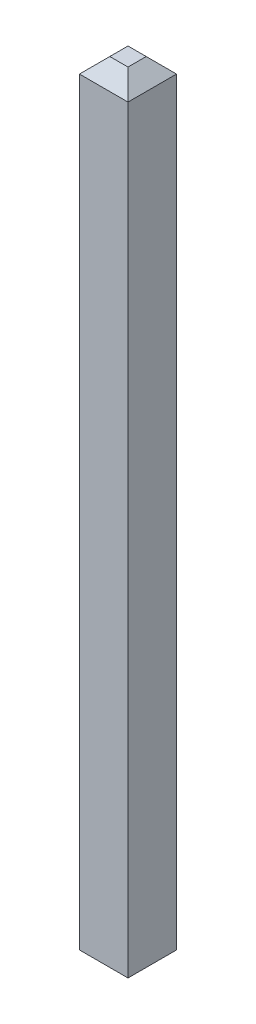
ISO-10303-21;
HEADER;
FILE_DESCRIPTION(('STEP AP214'),'2;1');
FILE_NAME('part.step','',(''),(''),'','','');
FILE_SCHEMA(('AUTOMOTIVE_DESIGN { 1 0 10303 214 1 1 1 1 }'));
ENDSEC;
DATA;
#1=APPLICATION_CONTEXT('core data for automotive mechanical design processes');
#2=APPLICATION_PROTOCOL_DEFINITION('international standard','automotive_design',2000,#1);
#3=PRODUCT_CONTEXT('',#1,'mechanical');
#4=PRODUCT('Part','Part','',(#3));
#5=PRODUCT_RELATED_PRODUCT_CATEGORY('part','',(#4));
#6=PRODUCT_DEFINITION_FORMATION('','',#4);
#7=PRODUCT_DEFINITION_CONTEXT('part definition',#1,'design');
#8=PRODUCT_DEFINITION('design','',#6,#7);
#9=PRODUCT_DEFINITION_SHAPE('','',#8);
#10=(LENGTH_UNIT() NAMED_UNIT(*) SI_UNIT(.MILLI.,.METRE.));
#11=(NAMED_UNIT(*) PLANE_ANGLE_UNIT() SI_UNIT($,.RADIAN.));
#12=(NAMED_UNIT(*) SI_UNIT($,.STERADIAN.) SOLID_ANGLE_UNIT());
#13=UNCERTAINTY_MEASURE_WITH_UNIT(LENGTH_MEASURE(1.E-05),#10,'distance_accuracy_value','');
#14=(GEOMETRIC_REPRESENTATION_CONTEXT(3) GLOBAL_UNCERTAINTY_ASSIGNED_CONTEXT((#13)) GLOBAL_UNIT_ASSIGNED_CONTEXT((#10,
#11,#12)) REPRESENTATION_CONTEXT('',''));
#15=CARTESIAN_POINT('',(0.,0.,0.));
#16=DIRECTION('',(0.,0.,1.));
#17=DIRECTION('',(1.,0.,0.));
#18=AXIS2_PLACEMENT_3D('',#15,#16,#17);
#19=CARTESIAN_POINT('',(0.,10.4,0.12));
#20=DIRECTION('',(0.,-0.707106781186544,-0.707106781186551));
#21=DIRECTION('',(0.,-0.707106781186551,0.707106781186544));
#22=AXIS2_PLACEMENT_3D('',#19,#20,#21);
#23=PLANE('',#22);
#24=DIRECTION('',(-0.577350269189624,-0.577350269189629,0.577350269189624));
#25=VECTOR('',#24,1.);
#26=CARTESIAN_POINT('',(-0.08,10.44,0.08));
#27=LINE('',#26,#25);
#28=CARTESIAN_POINT('',(-0.12,10.4,0.12));
#29=VERTEX_POINT('',#28);
#30=CARTESIAN_POINT('',(-0.32,10.2,0.32));
#31=VERTEX_POINT('',#30);
#32=EDGE_CURVE('E27',#29,#31,#27,.T.);
#33=ORIENTED_EDGE('',*,*,#32,.T.);
#34=DIRECTION('',(-1.,0.,0.));
#35=VECTOR('',#34,1.);
#36=CARTESIAN_POINT('',(-0.32,10.2,0.32));
#37=LINE('',#36,#35);
#38=CARTESIAN_POINT('',(0.32,10.2,0.32));
#39=VERTEX_POINT('',#38);
#40=EDGE_CURVE('E146',#39,#31,#37,.T.);
#41=ORIENTED_EDGE('',*,*,#40,.F.);
#42=DIRECTION('',(-0.577350269189624,0.577350269189629,-0.577350269189624));
#43=VECTOR('',#42,1.);
#44=CARTESIAN_POINT('',(0.08,10.44,0.08));
#45=LINE('',#44,#43);
#46=CARTESIAN_POINT('',(0.12,10.4,0.12));
#47=VERTEX_POINT('',#46);
#48=EDGE_CURVE('E11',#39,#47,#45,.T.);
#49=ORIENTED_EDGE('',*,*,#48,.T.);
#50=DIRECTION('',(1.,0.,0.));
#51=VECTOR('',#50,1.);
#52=CARTESIAN_POINT('',(0.,10.4,0.12));
#53=LINE('',#52,#51);
#54=EDGE_CURVE('E177',#29,#47,#53,.T.);
#55=ORIENTED_EDGE('',*,*,#54,.F.);
#56=EDGE_LOOP('',(#33,#41,#49,#55));
#57=FACE_BOUND('',#56,.T.);
#58=ADVANCED_FACE('F17',(#57),#23,.F.);
#59=CARTESIAN_POINT('',(0.12,10.4,0.));
#60=DIRECTION('',(-0.707106781186551,-0.707106781186544,0.));
#61=DIRECTION('',(-0.707106781186544,0.707106781186551,0.));
#62=AXIS2_PLACEMENT_3D('',#59,#60,#61);
#63=PLANE('',#62);
#64=DIRECTION('',(-0.577350269189624,0.577350269189629,0.577350269189624));
#65=VECTOR('',#64,1.);
#66=CARTESIAN_POINT('',(0.08,10.44,-0.08));
#67=LINE('',#66,#65);
#68=CARTESIAN_POINT('',(0.32,10.2,-0.32));
#69=VERTEX_POINT('',#68);
#70=CARTESIAN_POINT('',(0.12,10.4,-0.12));
#71=VERTEX_POINT('',#70);
#72=EDGE_CURVE('E165',#69,#71,#67,.T.);
#73=ORIENTED_EDGE('',*,*,#72,.T.);
#74=DIRECTION('',(0.,0.,-1.));
#75=VECTOR('',#74,1.);
#76=CARTESIAN_POINT('',(0.12,10.4,0.));
#77=LINE('',#76,#75);
#78=EDGE_CURVE('E137',#47,#71,#77,.T.);
#79=ORIENTED_EDGE('',*,*,#78,.F.);
#80=ORIENTED_EDGE('',*,*,#48,.F.);
#81=DIRECTION('',(0.,0.,1.));
#82=VECTOR('',#81,1.);
#83=CARTESIAN_POINT('',(0.32,10.2,0.32));
#84=LINE('',#83,#82);
#85=EDGE_CURVE('E140',#69,#39,#84,.T.);
#86=ORIENTED_EDGE('',*,*,#85,.F.);
#87=EDGE_LOOP('',(#73,#79,#80,#86));
#88=FACE_BOUND('',#87,.T.);
#89=ADVANCED_FACE('F401',(#88),#63,.F.);
#90=CARTESIAN_POINT('',(-0.12,10.4,0.));
#91=DIRECTION('',(0.707106781186551,-0.707106781186544,0.));
#92=DIRECTION('',(0.,0.,-1.));
#93=AXIS2_PLACEMENT_3D('',#90,#91,#92);
#94=PLANE('',#93);
#95=DIRECTION('',(-0.577350269189624,-0.577350269189629,-0.577350269189624));
#96=VECTOR('',#95,1.);
#97=CARTESIAN_POINT('',(-0.08,10.44,-0.08));
#98=LINE('',#97,#96);
#99=CARTESIAN_POINT('',(-0.12,10.4,-0.12));
#100=VERTEX_POINT('',#99);
#101=CARTESIAN_POINT('',(-0.32,10.2,-0.32));
#102=VERTEX_POINT('',#101);
#103=EDGE_CURVE('E162',#100,#102,#98,.T.);
#104=ORIENTED_EDGE('',*,*,#103,.T.);
#105=DIRECTION('',(0.,0.,-1.));
#106=VECTOR('',#105,1.);
#107=CARTESIAN_POINT('',(-0.32,10.2,0.32));
#108=LINE('',#107,#106);
#109=EDGE_CURVE('E154',#31,#102,#108,.T.);
#110=ORIENTED_EDGE('',*,*,#109,.F.);
#111=ORIENTED_EDGE('',*,*,#32,.F.);
#112=DIRECTION('',(0.,0.,1.));
#113=VECTOR('',#112,1.);
#114=CARTESIAN_POINT('',(-0.12,10.4,0.));
#115=LINE('',#114,#113);
#116=EDGE_CURVE('E150',#100,#29,#115,.T.);
#117=ORIENTED_EDGE('',*,*,#116,.F.);
#118=EDGE_LOOP('',(#104,#110,#111,#117));
#119=FACE_BOUND('',#118,.T.);
#120=ADVANCED_FACE('F392',(#119),#94,.F.);
#121=CARTESIAN_POINT('',(0.,10.4,-0.12));
#122=DIRECTION('',(0.,-0.707106781186544,0.707106781186551));
#123=DIRECTION('',(-1.,0.,0.));
#124=AXIS2_PLACEMENT_3D('',#121,#122,#123);
#125=PLANE('',#124);
#126=ORIENTED_EDGE('',*,*,#72,.F.);
#127=DIRECTION('',(1.,0.,0.));
#128=VECTOR('',#127,1.);
#129=CARTESIAN_POINT('',(-0.32,10.2,-0.32));
#130=LINE('',#129,#128);
#131=EDGE_CURVE('E160',#102,#69,#130,.T.);
#132=ORIENTED_EDGE('',*,*,#131,.F.);
#133=ORIENTED_EDGE('',*,*,#103,.F.);
#134=DIRECTION('',(-1.,0.,0.));
#135=VECTOR('',#134,1.);
#136=CARTESIAN_POINT('',(0.,10.4,-0.12));
#137=LINE('',#136,#135);
#138=EDGE_CURVE('E128',#71,#100,#137,.T.);
#139=ORIENTED_EDGE('',*,*,#138,.F.);
#140=EDGE_LOOP('',(#126,#132,#133,#139));
#141=FACE_BOUND('',#140,.T.);
#142=ADVANCED_FACE('F384',(#141),#125,.F.);
#143=CARTESIAN_POINT('',(-0.32,0.2,-0.32));
#144=DIRECTION('',(0.,-0.707106781186551,-0.707106781186544));
#145=DIRECTION('',(0.,0.707106781186544,-0.707106781186551));
#146=AXIS2_PLACEMENT_3D('',#143,#144,#145);
#147=PLANE('',#146);
#148=DIRECTION('',(-0.577350269189627,-0.577350269189623,0.577350269189627));
#149=VECTOR('',#148,1.);
#150=CARTESIAN_POINT('',(0.106666666666665,-0.013333333333334,-0.106666666666665));
#151=LINE('',#150,#149);
#152=CARTESIAN_POINT('',(0.32,0.2,-0.32));
#153=VERTEX_POINT('',#152);
#154=CARTESIAN_POINT('',(0.12,0.,-0.12));
#155=VERTEX_POINT('',#154);
#156=EDGE_CURVE('E53',#153,#155,#151,.T.);
#157=ORIENTED_EDGE('',*,*,#156,.T.);
#158=DIRECTION('',(1.,0.,0.));
#159=VECTOR('',#158,1.);
#160=CARTESIAN_POINT('',(0.32,0.,-0.12));
#161=LINE('',#160,#159);
#162=CARTESIAN_POINT('',(-0.12,0.,-0.12));
#163=VERTEX_POINT('',#162);
#164=EDGE_CURVE('E127',#163,#155,#161,.T.);
#165=ORIENTED_EDGE('',*,*,#164,.F.);
#166=DIRECTION('',(-0.577350269189627,0.577350269189623,-0.577350269189627));
#167=VECTOR('',#166,1.);
#168=CARTESIAN_POINT('',(-0.106666666666665,-0.013333333333334,-0.106666666666665));
#169=LINE('',#168,#167);
#170=CARTESIAN_POINT('',(-0.32,0.2,-0.32));
#171=VERTEX_POINT('',#170);
#172=EDGE_CURVE('E125',#163,#171,#169,.T.);
#173=ORIENTED_EDGE('',*,*,#172,.T.);
#174=DIRECTION('',(-1.,0.,0.));
#175=VECTOR('',#174,1.);
#176=CARTESIAN_POINT('',(-0.32,0.2,-0.32));
#177=LINE('',#176,#175);
#178=EDGE_CURVE('E144',#153,#171,#177,.T.);
#179=ORIENTED_EDGE('',*,*,#178,.F.);
#180=EDGE_LOOP('',(#157,#165,#173,#179));
#181=FACE_BOUND('',#180,.T.);
#182=ADVANCED_FACE('F376',(#181),#147,.T.);
#183=CARTESIAN_POINT('',(-0.32,0.2,0.32));
#184=DIRECTION('',(-0.707106781186544,-0.707106781186551,0.));
#185=DIRECTION('',(-0.707106781186551,0.707106781186544,0.));
#186=AXIS2_PLACEMENT_3D('',#183,#184,#185);
#187=PLANE('',#186);
#188=DIRECTION('',(-0.577350269189627,0.577350269189623,0.577350269189627));
#189=VECTOR('',#188,1.);
#190=CARTESIAN_POINT('',(-0.32,0.2,0.32));
#191=LINE('',#190,#189);
#192=CARTESIAN_POINT('',(-0.12,0.,0.12));
#193=VERTEX_POINT('',#192);
#194=CARTESIAN_POINT('',(-0.32,0.2,0.32));
#195=VERTEX_POINT('',#194);
#196=EDGE_CURVE('E103',#193,#195,#191,.T.);
#197=ORIENTED_EDGE('',*,*,#196,.T.);
#198=DIRECTION('',(0.,0.,1.));
#199=VECTOR('',#198,1.);
#200=CARTESIAN_POINT('',(-0.32,0.2,0.32));
#201=LINE('',#200,#199);
#202=EDGE_CURVE('E155',#171,#195,#201,.T.);
#203=ORIENTED_EDGE('',*,*,#202,.F.);
#204=ORIENTED_EDGE('',*,*,#172,.F.);
#205=DIRECTION('',(0.,0.,-1.));
#206=VECTOR('',#205,1.);
#207=CARTESIAN_POINT('',(-0.12,0.,-0.32));
#208=LINE('',#207,#206);
#209=EDGE_CURVE('E120',#193,#163,#208,.T.);
#210=ORIENTED_EDGE('',*,*,#209,.F.);
#211=EDGE_LOOP('',(#197,#203,#204,#210));
#212=FACE_BOUND('',#211,.T.);
#213=ADVANCED_FACE('F124',(#212),#187,.T.);
#214=CARTESIAN_POINT('',(0.32,0.2,0.32));
#215=DIRECTION('',(0.707106781186544,-0.707106781186551,0.));
#216=DIRECTION('',(0.,0.,-1.));
#217=AXIS2_PLACEMENT_3D('',#214,#215,#216);
#218=PLANE('',#217);
#219=DIRECTION('',(-0.577350269189627,-0.577350269189623,-0.577350269189627));
#220=VECTOR('',#219,1.);
#221=CARTESIAN_POINT('',(0.32,0.2,0.32));
#222=LINE('',#221,#220);
#223=CARTESIAN_POINT('',(0.32,0.2,0.32));
#224=VERTEX_POINT('',#223);
#225=CARTESIAN_POINT('',(0.12,0.,0.12));
#226=VERTEX_POINT('',#225);
#227=EDGE_CURVE('E40',#224,#226,#222,.T.);
#228=ORIENTED_EDGE('',*,*,#227,.T.);
#229=DIRECTION('',(0.,0.,1.));
#230=VECTOR('',#229,1.);
#231=CARTESIAN_POINT('',(0.12,0.,0.32));
#232=LINE('',#231,#230);
#233=EDGE_CURVE('E121',#155,#226,#232,.T.);
#234=ORIENTED_EDGE('',*,*,#233,.F.);
#235=ORIENTED_EDGE('',*,*,#156,.F.);
#236=DIRECTION('',(0.,0.,-1.));
#237=VECTOR('',#236,1.);
#238=CARTESIAN_POINT('',(0.32,0.2,-0.32));
#239=LINE('',#238,#237);
#240=EDGE_CURVE('E21',#224,#153,#239,.T.);
#241=ORIENTED_EDGE('',*,*,#240,.F.);
#242=EDGE_LOOP('',(#228,#234,#235,#241));
#243=FACE_BOUND('',#242,.T.);
#244=ADVANCED_FACE('F360',(#243),#218,.T.);
#245=CARTESIAN_POINT('',(-0.32,0.2,0.32));
#246=DIRECTION('',(0.,-0.707106781186551,0.707106781186544));
#247=DIRECTION('',(-1.,0.,0.));
#248=AXIS2_PLACEMENT_3D('',#245,#246,#247);
#249=PLANE('',#248);
#250=ORIENTED_EDGE('',*,*,#196,.F.);
#251=DIRECTION('',(-1.,0.,0.));
#252=VECTOR('',#251,1.);
#253=CARTESIAN_POINT('',(-0.32,0.,0.12));
#254=LINE('',#253,#252);
#255=EDGE_CURVE('E106',#226,#193,#254,.T.);
#256=ORIENTED_EDGE('',*,*,#255,.F.);
#257=ORIENTED_EDGE('',*,*,#227,.F.);
#258=DIRECTION('',(1.,0.,0.));
#259=VECTOR('',#258,1.);
#260=CARTESIAN_POINT('',(0.32,0.2,0.32));
#261=LINE('',#260,#259);
#262=EDGE_CURVE('E109',#195,#224,#261,.T.);
#263=ORIENTED_EDGE('',*,*,#262,.F.);
#264=EDGE_LOOP('',(#250,#256,#257,#263));
#265=FACE_BOUND('',#264,.T.);
#266=ADVANCED_FACE('F105',(#265),#249,.T.);
#267=CARTESIAN_POINT('',(0.,0.,0.));
#268=DIRECTION('',(0.,-1.,0.));
#269=DIRECTION('',(0.,0.,-1.));
#270=AXIS2_PLACEMENT_3D('',#267,#268,#269);
#271=PLANE('',#270);
#272=ORIENTED_EDGE('',*,*,#209,.T.);
#273=ORIENTED_EDGE('',*,*,#164,.T.);
#274=ORIENTED_EDGE('',*,*,#233,.T.);
#275=ORIENTED_EDGE('',*,*,#255,.T.);
#276=EDGE_LOOP('',(#272,#273,#274,#275));
#277=FACE_BOUND('',#276,.T.);
#278=ADVANCED_FACE('F118',(#277),#271,.T.);
#279=CARTESIAN_POINT('',(0.,10.4,0.));
#280=DIRECTION('',(0.,-1.,0.));
#281=DIRECTION('',(0.,0.,-1.));
#282=AXIS2_PLACEMENT_3D('',#279,#280,#281);
#283=PLANE('',#282);
#284=ORIENTED_EDGE('',*,*,#116,.T.);
#285=ORIENTED_EDGE('',*,*,#54,.T.);
#286=ORIENTED_EDGE('',*,*,#78,.T.);
#287=ORIENTED_EDGE('',*,*,#138,.T.);
#288=EDGE_LOOP('',(#284,#285,#286,#287));
#289=FACE_BOUND('',#288,.T.);
#290=ADVANCED_FACE('F332',(#289),#283,.F.);
#291=CARTESIAN_POINT('',(-0.32,10.4,0.32));
#292=DIRECTION('',(0.,0.,-1.));
#293=DIRECTION('',(0.,-1.,0.));
#294=AXIS2_PLACEMENT_3D('',#291,#292,#293);
#295=PLANE('',#294);
#296=DIRECTION('',(0.,-1.,0.));
#297=VECTOR('',#296,1.);
#298=CARTESIAN_POINT('',(-0.32,10.4,0.32));
#299=LINE('',#298,#297);
#300=EDGE_CURVE('E151',#31,#195,#299,.T.);
#301=ORIENTED_EDGE('',*,*,#300,.T.);
#302=ORIENTED_EDGE('',*,*,#262,.T.);
#303=DIRECTION('',(0.,-1.,0.));
#304=VECTOR('',#303,1.);
#305=CARTESIAN_POINT('',(0.32,10.4,0.32));
#306=LINE('',#305,#304);
#307=EDGE_CURVE('E168',#39,#224,#306,.T.);
#308=ORIENTED_EDGE('',*,*,#307,.F.);
#309=ORIENTED_EDGE('',*,*,#40,.T.);
#310=EDGE_LOOP('',(#301,#302,#308,#309));
#311=FACE_BOUND('',#310,.T.);
#312=ADVANCED_FACE('F320',(#311),#295,.F.);
#313=CARTESIAN_POINT('',(-0.32,10.4,0.32));
#314=DIRECTION('',(1.,0.,0.));
#315=DIRECTION('',(0.,1.,0.));
#316=AXIS2_PLACEMENT_3D('',#313,#314,#315);
#317=PLANE('',#316);
#318=DIRECTION('',(0.,-1.,0.));
#319=VECTOR('',#318,1.);
#320=CARTESIAN_POINT('',(-0.32,10.4,-0.32));
#321=LINE('',#320,#319);
#322=EDGE_CURVE('E180',#102,#171,#321,.T.);
#323=ORIENTED_EDGE('',*,*,#322,.T.);
#324=ORIENTED_EDGE('',*,*,#202,.T.);
#325=ORIENTED_EDGE('',*,*,#300,.F.);
#326=ORIENTED_EDGE('',*,*,#109,.T.);
#327=EDGE_LOOP('',(#323,#324,#325,#326));
#328=FACE_BOUND('',#327,.T.);
#329=ADVANCED_FACE('F308',(#328),#317,.F.);
#330=CARTESIAN_POINT('',(-0.32,10.4,-0.32));
#331=DIRECTION('',(0.,0.,1.));
#332=DIRECTION('',(1.,0.,0.));
#333=AXIS2_PLACEMENT_3D('',#330,#331,#332);
#334=PLANE('',#333);
#335=DIRECTION('',(0.,-1.,0.));
#336=VECTOR('',#335,1.);
#337=CARTESIAN_POINT('',(0.32,10.4,-0.32));
#338=LINE('',#337,#336);
#339=EDGE_CURVE('E145',#69,#153,#338,.T.);
#340=ORIENTED_EDGE('',*,*,#339,.T.);
#341=ORIENTED_EDGE('',*,*,#178,.T.);
#342=ORIENTED_EDGE('',*,*,#322,.F.);
#343=ORIENTED_EDGE('',*,*,#131,.T.);
#344=EDGE_LOOP('',(#340,#341,#342,#343));
#345=FACE_BOUND('',#344,.T.);
#346=ADVANCED_FACE('F296',(#345),#334,.F.);
#347=CARTESIAN_POINT('',(0.32,10.4,0.32));
#348=DIRECTION('',(-1.,0.,0.));
#349=DIRECTION('',(0.,0.,1.));
#350=AXIS2_PLACEMENT_3D('',#347,#348,#349);
#351=PLANE('',#350);
#352=ORIENTED_EDGE('',*,*,#307,.T.);
#353=ORIENTED_EDGE('',*,*,#240,.T.);
#354=ORIENTED_EDGE('',*,*,#339,.F.);
#355=ORIENTED_EDGE('',*,*,#85,.T.);
#356=EDGE_LOOP('',(#352,#353,#354,#355));
#357=FACE_BOUND('',#356,.T.);
#358=ADVANCED_FACE('F19',(#357),#351,.F.);
#359=CLOSED_SHELL('',(#58,#89,#120,#142,#182,#213,#244,#266,#278,#290,#312,#329,#346,#358));
#360=MANIFOLD_SOLID_BREP('B1',#359);
#361=ADVANCED_BREP_SHAPE_REPRESENTATION('',(#18,#360),#14);
#362=SHAPE_DEFINITION_REPRESENTATION(#9,#361);
ENDSEC;
END-ISO-10303-21;
